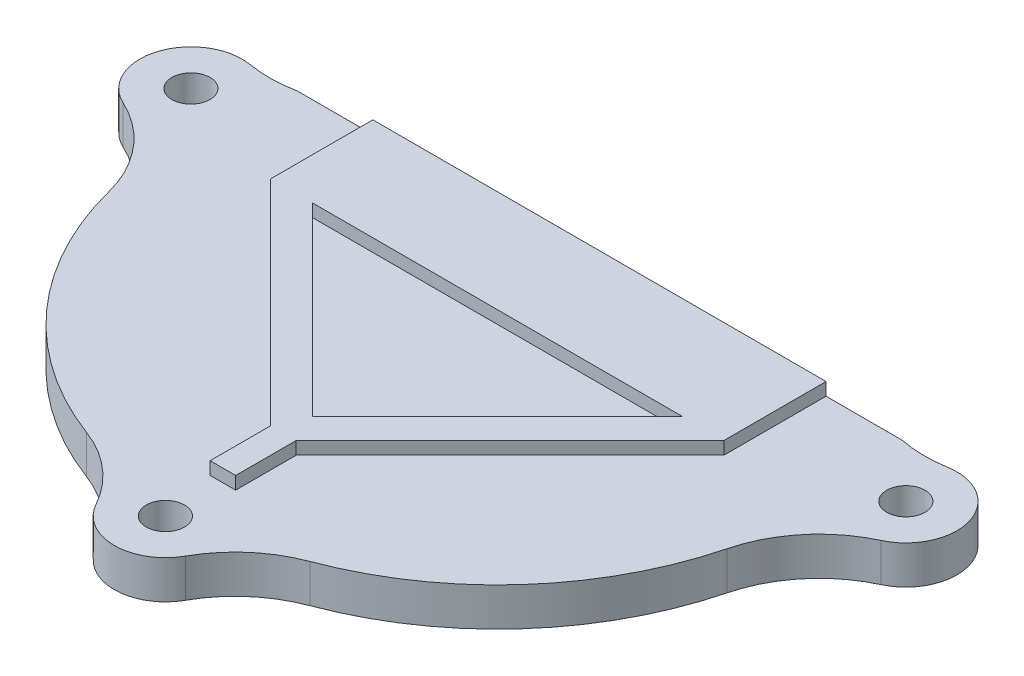
ISO-10303-21;
HEADER;
FILE_DESCRIPTION(('STEP AP214'),'2;1');
FILE_NAME('part.step','',(''),(''),'','','');
FILE_SCHEMA(('AUTOMOTIVE_DESIGN { 1 0 10303 214 1 1 1 1 }'));
ENDSEC;
DATA;
#1=APPLICATION_CONTEXT('core data for automotive mechanical design processes');
#2=APPLICATION_PROTOCOL_DEFINITION('international standard','automotive_design',2000,#1);
#3=PRODUCT_CONTEXT('',#1,'mechanical');
#4=PRODUCT('Part','Part','',(#3));
#5=PRODUCT_RELATED_PRODUCT_CATEGORY('part','',(#4));
#6=PRODUCT_DEFINITION_FORMATION('','',#4);
#7=PRODUCT_DEFINITION_CONTEXT('part definition',#1,'design');
#8=PRODUCT_DEFINITION('design','',#6,#7);
#9=PRODUCT_DEFINITION_SHAPE('','',#8);
#10=(LENGTH_UNIT() NAMED_UNIT(*) SI_UNIT(.MILLI.,.METRE.));
#11=(NAMED_UNIT(*) PLANE_ANGLE_UNIT() SI_UNIT($,.RADIAN.));
#12=(NAMED_UNIT(*) SI_UNIT($,.STERADIAN.) SOLID_ANGLE_UNIT());
#13=UNCERTAINTY_MEASURE_WITH_UNIT(LENGTH_MEASURE(1.E-05),#10,'distance_accuracy_value','');
#14=(GEOMETRIC_REPRESENTATION_CONTEXT(3) GLOBAL_UNCERTAINTY_ASSIGNED_CONTEXT((#13)) GLOBAL_UNIT_ASSIGNED_CONTEXT((#10,
#11,#12)) REPRESENTATION_CONTEXT('',''));
#15=CARTESIAN_POINT('',(0.,0.,0.));
#16=DIRECTION('',(0.,0.,1.));
#17=DIRECTION('',(1.,0.,0.));
#18=AXIS2_PLACEMENT_3D('',#15,#16,#17);
#19=CARTESIAN_POINT('',(57.9277984312657,2.,35.3394238594462));
#20=DIRECTION('',(0.,-1.,0.));
#21=DIRECTION('',(0.,0.,-1.));
#22=AXIS2_PLACEMENT_3D('',#19,#20,#21);
#23=CYLINDRICAL_SURFACE('',#22,25.);
#24=CARTESIAN_POINT('',(57.9277984312657,-1.,35.3394238594462));
#25=DIRECTION('',(0.,-1.,0.));
#26=DIRECTION('',(0.,0.,-1.));
#27=AXIS2_PLACEMENT_3D('',#24,#25,#26);
#28=CIRCLE('',#27,25.);
#29=CARTESIAN_POINT('',(49.1820475696715,-1.,58.7597535297759));
#30=VERTEX_POINT('',#29);
#31=CARTESIAN_POINT('',(33.7114973293791,-1.,41.549960144081));
#32=VERTEX_POINT('',#31);
#33=EDGE_CURVE('E392',#30,#32,#28,.T.);
#34=ORIENTED_EDGE('',*,*,#33,.F.);
#35=DIRECTION('',(0.,-1.,0.));
#36=VECTOR('',#35,1.);
#37=CARTESIAN_POINT('',(49.1820475696715,2.,58.7597535297759));
#38=LINE('',#37,#36);
#39=CARTESIAN_POINT('',(49.1820475696715,2.,58.7597535297759));
#40=VERTEX_POINT('',#39);
#41=EDGE_CURVE('E292',#30,#40,#38,.F.);
#42=ORIENTED_EDGE('',*,*,#41,.T.);
#43=CARTESIAN_POINT('',(57.9277984312657,2.,35.3394238594462));
#44=DIRECTION('',(0.,1.,0.));
#45=DIRECTION('',(0.,0.,1.));
#46=AXIS2_PLACEMENT_3D('',#43,#44,#45);
#47=CIRCLE('',#46,25.);
#48=CARTESIAN_POINT('',(33.7114973293791,2.,41.549960144081));
#49=VERTEX_POINT('',#48);
#50=EDGE_CURVE('E276',#49,#40,#47,.T.);
#51=ORIENTED_EDGE('',*,*,#50,.F.);
#52=DIRECTION('',(0.,-1.,0.));
#53=VECTOR('',#52,1.);
#54=CARTESIAN_POINT('',(33.7114973293791,2.,41.549960144081));
#55=LINE('',#54,#53);
#56=EDGE_CURVE('E289',#49,#32,#55,.T.);
#57=ORIENTED_EDGE('',*,*,#56,.T.);
#58=EDGE_LOOP('',(#34,#42,#51,#57));
#59=FACE_BOUND('',#58,.T.);
#60=ADVANCED_FACE('F41',(#59),#23,.T.);
#61=CARTESIAN_POINT('',(57.9277984312657,-1.,35.3394238594462));
#62=DIRECTION('',(0.,-1.,0.));
#63=DIRECTION('',(0.,0.,-1.));
#64=AXIS2_PLACEMENT_3D('',#61,#62,#63);
#65=CIRCLE('',#64,25.);
#66=CARTESIAN_POINT('',(82.1440995331523,-1.,41.549960144081));
#67=VERTEX_POINT('',#66);
#68=CARTESIAN_POINT('',(66.6735492928599,-1.,58.7597535297759));
#69=VERTEX_POINT('',#68);
#70=EDGE_CURVE('E380',#67,#69,#65,.T.);
#71=ORIENTED_EDGE('',*,*,#70,.F.);
#72=DIRECTION('',(0.,-1.,0.));
#73=VECTOR('',#72,1.);
#74=CARTESIAN_POINT('',(82.1440995331523,2.,41.549960144081));
#75=LINE('',#74,#73);
#76=CARTESIAN_POINT('',(82.1440995331523,2.,41.549960144081));
#77=VERTEX_POINT('',#76);
#78=EDGE_CURVE('E279',#67,#77,#75,.F.);
#79=ORIENTED_EDGE('',*,*,#78,.T.);
#80=CARTESIAN_POINT('',(66.6735492928599,2.,58.7597535297759));
#81=VERTEX_POINT('',#80);
#82=EDGE_CURVE('E275',#81,#77,#47,.T.);
#83=ORIENTED_EDGE('',*,*,#82,.F.);
#84=DIRECTION('',(0.,-1.,0.));
#85=VECTOR('',#84,1.);
#86=CARTESIAN_POINT('',(66.6735492928599,2.,58.7597535297759));
#87=LINE('',#86,#85);
#88=EDGE_CURVE('E281',#81,#69,#87,.T.);
#89=ORIENTED_EDGE('',*,*,#88,.T.);
#90=EDGE_LOOP('',(#71,#79,#83,#89));
#91=FACE_BOUND('',#90,.T.);
#92=ADVANCED_FACE('F429',(#91),#23,.T.);
#93=CARTESIAN_POINT('',(85.9277984312657,0.,31.3394238594462));
#94=DIRECTION('',(0.,1.,0.));
#95=DIRECTION('',(0.,0.,1.));
#96=AXIS2_PLACEMENT_3D('',#93,#94,#95);
#97=CYLINDRICAL_SURFACE('',#96,3.99999999999999);
#98=CARTESIAN_POINT('',(85.9277984312657,-1.,31.3394238594462));
#99=DIRECTION('',(0.,-1.,0.));
#100=DIRECTION('',(0.,0.,-1.));
#101=AXIS2_PLACEMENT_3D('',#98,#99,#100);
#102=CIRCLE('',#101,3.99999999999999);
#103=CARTESIAN_POINT('',(87.6143188720203,-1.,34.9664955161573));
#104=VERTEX_POINT('',#103);
#105=CARTESIAN_POINT('',(85.2592728947169,-1.,27.3956853276744));
#106=VERTEX_POINT('',#105);
#107=EDGE_CURVE('E386',#104,#106,#102,.F.);
#108=ORIENTED_EDGE('',*,*,#107,.T.);
#109=DIRECTION('',(0.,1.,0.));
#110=VECTOR('',#109,1.);
#111=CARTESIAN_POINT('',(85.2592728947169,0.,27.3956853276744));
#112=LINE('',#111,#110);
#113=CARTESIAN_POINT('',(85.2592728947169,2.,27.3956853276744));
#114=VERTEX_POINT('',#113);
#115=EDGE_CURVE('E298',#106,#114,#112,.T.);
#116=ORIENTED_EDGE('',*,*,#115,.T.);
#117=CARTESIAN_POINT('',(85.9277984312657,2.,31.3394238594462));
#118=DIRECTION('',(0.,1.,0.));
#119=DIRECTION('',(0.,0.,1.));
#120=AXIS2_PLACEMENT_3D('',#117,#118,#119);
#121=CIRCLE('',#120,3.99999999999999);
#122=CARTESIAN_POINT('',(87.6143188720203,2.,34.9664955161573));
#123=VERTEX_POINT('',#122);
#124=EDGE_CURVE('E272',#123,#114,#121,.T.);
#125=ORIENTED_EDGE('',*,*,#124,.F.);
#126=DIRECTION('',(0.,1.,0.));
#127=VECTOR('',#126,1.);
#128=CARTESIAN_POINT('',(87.6143188720203,0.,34.9664955161573));
#129=LINE('',#128,#127);
#130=EDGE_CURVE('E300',#123,#104,#129,.F.);
#131=ORIENTED_EDGE('',*,*,#130,.T.);
#132=EDGE_LOOP('',(#108,#116,#125,#131));
#133=FACE_BOUND('',#132,.T.);
#134=ADVANCED_FACE('F439',(#133),#97,.T.);
#135=CARTESIAN_POINT('',(85.9277984312657,0.,31.3394238594462));
#136=DIRECTION('',(0.,1.,0.));
#137=DIRECTION('',(0.,0.,1.));
#138=AXIS2_PLACEMENT_3D('',#135,#136,#137);
#139=CYLINDRICAL_SURFACE('',#138,1.5);
#140=CARTESIAN_POINT('',(85.9277984312657,2.,31.3394238594462));
#141=DIRECTION('',(0.,1.,0.));
#142=DIRECTION('',(0.,0.,1.));
#143=AXIS2_PLACEMENT_3D('',#140,#141,#142);
#144=CIRCLE('',#143,1.5);
#145=CARTESIAN_POINT('',(85.9277984312657,2.,32.8394238594462));
#146=VERTEX_POINT('',#145);
#147=EDGE_CURVE('E269',#146,#146,#144,.T.);
#148=ORIENTED_EDGE('',*,*,#147,.T.);
#149=EDGE_LOOP('',(#148));
#150=FACE_BOUND('',#149,.T.);
#151=CARTESIAN_POINT('',(85.9277984312657,-1.,31.3394238594462));
#152=DIRECTION('',(0.,-1.,0.));
#153=DIRECTION('',(0.,0.,-1.));
#154=AXIS2_PLACEMENT_3D('',#151,#152,#153);
#155=CIRCLE('',#154,1.5);
#156=CARTESIAN_POINT('',(85.9277984312657,-1.,29.8394238594462));
#157=VERTEX_POINT('',#156);
#158=EDGE_CURVE('E333',#157,#157,#155,.F.);
#159=ORIENTED_EDGE('',*,*,#158,.F.);
#160=EDGE_LOOP('',(#159));
#161=FACE_BOUND('',#160,.T.);
#162=ADVANCED_FACE('F606',(#150,#161),#139,.F.);
#163=CARTESIAN_POINT('',(29.9277984312657,0.,31.3394238594462));
#164=DIRECTION('',(0.,1.,0.));
#165=DIRECTION('',(0.,0.,1.));
#166=AXIS2_PLACEMENT_3D('',#163,#164,#165);
#167=CYLINDRICAL_SURFACE('',#166,4.);
#168=CARTESIAN_POINT('',(29.9277984312657,-1.,31.3394238594462));
#169=DIRECTION('',(0.,-1.,0.));
#170=DIRECTION('',(0.,0.,-1.));
#171=AXIS2_PLACEMENT_3D('',#168,#169,#170);
#172=CIRCLE('',#171,4.);
#173=CARTESIAN_POINT('',(30.5963239678145,-1.,27.3956853276744));
#174=VERTEX_POINT('',#173);
#175=CARTESIAN_POINT('',(28.2412779905111,-1.,34.9664955161573));
#176=VERTEX_POINT('',#175);
#177=EDGE_CURVE('E55',#174,#176,#172,.F.);
#178=ORIENTED_EDGE('',*,*,#177,.T.);
#179=DIRECTION('',(0.,1.,0.));
#180=VECTOR('',#179,1.);
#181=CARTESIAN_POINT('',(28.2412779905111,0.,34.9664955161573));
#182=LINE('',#181,#180);
#183=CARTESIAN_POINT('',(28.2412779905111,2.,34.9664955161573));
#184=VERTEX_POINT('',#183);
#185=EDGE_CURVE('E296',#176,#184,#182,.T.);
#186=ORIENTED_EDGE('',*,*,#185,.T.);
#187=CARTESIAN_POINT('',(29.9277984312657,2.,31.3394238594462));
#188=DIRECTION('',(0.,1.,0.));
#189=DIRECTION('',(0.,0.,1.));
#190=AXIS2_PLACEMENT_3D('',#187,#188,#189);
#191=CIRCLE('',#190,4.);
#192=CARTESIAN_POINT('',(30.5963239678145,2.,27.3956853276744));
#193=VERTEX_POINT('',#192);
#194=EDGE_CURVE('E266',#193,#184,#191,.T.);
#195=ORIENTED_EDGE('',*,*,#194,.F.);
#196=DIRECTION('',(0.,1.,0.));
#197=VECTOR('',#196,1.);
#198=CARTESIAN_POINT('',(30.5963239678145,0.,27.3956853276744));
#199=LINE('',#198,#197);
#200=EDGE_CURVE('E294',#193,#174,#199,.F.);
#201=ORIENTED_EDGE('',*,*,#200,.T.);
#202=EDGE_LOOP('',(#178,#186,#195,#201));
#203=FACE_BOUND('',#202,.T.);
#204=ADVANCED_FACE('F400',(#203),#167,.T.);
#205=CARTESIAN_POINT('',(57.9277984312657,0.,61.3394238594462));
#206=DIRECTION('',(0.,1.,0.));
#207=DIRECTION('',(0.,0.,1.));
#208=AXIS2_PLACEMENT_3D('',#205,#206,#207);
#209=CYLINDRICAL_SURFACE('',#208,4.00000000000001);
#210=DIRECTION('',(0.,1.,0.));
#211=VECTOR('',#210,1.);
#212=CARTESIAN_POINT('',(54.429498086628,0.,63.2789842990067));
#213=LINE('',#212,#211);
#214=CARTESIAN_POINT('',(54.429498086628,2.,63.2789842990067));
#215=VERTEX_POINT('',#214);
#216=CARTESIAN_POINT('',(54.429498086628,-1.,63.2789842990067));
#217=VERTEX_POINT('',#216);
#218=EDGE_CURVE('E284',#215,#217,#213,.F.);
#219=ORIENTED_EDGE('',*,*,#218,.T.);
#220=CARTESIAN_POINT('',(57.9277984312657,-1.,61.3394238594462));
#221=DIRECTION('',(0.,-1.,0.));
#222=DIRECTION('',(0.,0.,-1.));
#223=AXIS2_PLACEMENT_3D('',#220,#221,#222);
#224=CIRCLE('',#223,4.00000000000001);
#225=CARTESIAN_POINT('',(61.4260987759034,-1.,63.2789842990067));
#226=VERTEX_POINT('',#225);
#227=EDGE_CURVE('E387',#217,#226,#224,.F.);
#228=ORIENTED_EDGE('',*,*,#227,.T.);
#229=DIRECTION('',(0.,1.,0.));
#230=VECTOR('',#229,1.);
#231=CARTESIAN_POINT('',(61.4260987759034,0.,63.2789842990067));
#232=LINE('',#231,#230);
#233=CARTESIAN_POINT('',(61.4260987759034,2.,63.2789842990067));
#234=VERTEX_POINT('',#233);
#235=EDGE_CURVE('E287',#226,#234,#232,.T.);
#236=ORIENTED_EDGE('',*,*,#235,.T.);
#237=CARTESIAN_POINT('',(57.9277984312657,2.,61.3394238594462));
#238=DIRECTION('',(0.,1.,0.));
#239=DIRECTION('',(0.,0.,1.));
#240=AXIS2_PLACEMENT_3D('',#237,#238,#239);
#241=CIRCLE('',#240,4.00000000000001);
#242=EDGE_CURVE('E263',#215,#234,#241,.T.);
#243=ORIENTED_EDGE('',*,*,#242,.F.);
#244=EDGE_LOOP('',(#219,#228,#236,#243));
#245=FACE_BOUND('',#244,.T.);
#246=ADVANCED_FACE('F419',(#245),#209,.T.);
#247=CARTESIAN_POINT('',(57.9277984312657,0.,61.3394238594462));
#248=DIRECTION('',(0.,1.,0.));
#249=DIRECTION('',(0.,0.,1.));
#250=AXIS2_PLACEMENT_3D('',#247,#248,#249);
#251=CYLINDRICAL_SURFACE('',#250,1.5);
#252=CARTESIAN_POINT('',(57.9277984312657,2.,61.3394238594462));
#253=DIRECTION('',(0.,1.,0.));
#254=DIRECTION('',(0.,0.,1.));
#255=AXIS2_PLACEMENT_3D('',#252,#253,#254);
#256=CIRCLE('',#255,1.5);
#257=CARTESIAN_POINT('',(57.9277984312657,2.,62.8394238594462));
#258=VERTEX_POINT('',#257);
#259=EDGE_CURVE('E260',#258,#258,#256,.T.);
#260=ORIENTED_EDGE('',*,*,#259,.T.);
#261=EDGE_LOOP('',(#260));
#262=FACE_BOUND('',#261,.T.);
#263=CARTESIAN_POINT('',(57.9277984312657,-1.,61.3394238594462));
#264=DIRECTION('',(0.,-1.,0.));
#265=DIRECTION('',(0.,0.,-1.));
#266=AXIS2_PLACEMENT_3D('',#263,#264,#265);
#267=CIRCLE('',#266,1.5);
#268=CARTESIAN_POINT('',(57.9277984312657,-1.,59.8394238594462));
#269=VERTEX_POINT('',#268);
#270=EDGE_CURVE('E374',#269,#269,#267,.F.);
#271=ORIENTED_EDGE('',*,*,#270,.F.);
#272=EDGE_LOOP('',(#271));
#273=FACE_BOUND('',#272,.T.);
#274=ADVANCED_FACE('F634',(#262,#273),#251,.F.);
#275=CARTESIAN_POINT('',(29.9277984312657,0.,31.3394238594462));
#276=DIRECTION('',(0.,1.,0.));
#277=DIRECTION('',(0.,0.,1.));
#278=AXIS2_PLACEMENT_3D('',#275,#276,#277);
#279=CYLINDRICAL_SURFACE('',#278,1.5);
#280=CARTESIAN_POINT('',(29.9277984312657,2.,31.3394238594462));
#281=DIRECTION('',(0.,1.,0.));
#282=DIRECTION('',(0.,0.,1.));
#283=AXIS2_PLACEMENT_3D('',#280,#281,#282);
#284=CIRCLE('',#283,1.5);
#285=CARTESIAN_POINT('',(29.9277984312657,2.,32.8394238594462));
#286=VERTEX_POINT('',#285);
#287=EDGE_CURVE('E257',#286,#286,#284,.T.);
#288=ORIENTED_EDGE('',*,*,#287,.T.);
#289=EDGE_LOOP('',(#288));
#290=FACE_BOUND('',#289,.T.);
#291=CARTESIAN_POINT('',(29.9277984312657,-1.,31.3394238594462));
#292=DIRECTION('',(0.,-1.,0.));
#293=DIRECTION('',(0.,0.,-1.));
#294=AXIS2_PLACEMENT_3D('',#291,#292,#293);
#295=CIRCLE('',#294,1.5);
#296=CARTESIAN_POINT('',(29.9277984312657,-1.,29.8394238594462));
#297=VERTEX_POINT('',#296);
#298=EDGE_CURVE('E377',#297,#297,#295,.F.);
#299=ORIENTED_EDGE('',*,*,#298,.F.);
#300=EDGE_LOOP('',(#299));
#301=FACE_BOUND('',#300,.T.);
#302=ADVANCED_FACE('F644',(#290,#301),#279,.F.);
#303=CARTESIAN_POINT('',(40.1777984312657,3.,27.3394238594462));
#304=DIRECTION('',(0.,0.,1.));
#305=DIRECTION('',(1.,0.,0.));
#306=AXIS2_PLACEMENT_3D('',#303,#304,#305);
#307=PLANE('',#306);
#308=DIRECTION('',(1.,0.,0.));
#309=VECTOR('',#308,1.);
#310=CARTESIAN_POINT('',(40.1777984312657,-1.,27.3394238594462));
#311=LINE('',#310,#309);
#312=CARTESIAN_POINT('',(34.2423598666117,-1.,27.3394238594463));
#313=VERTEX_POINT('',#312);
#314=CARTESIAN_POINT('',(81.6132369959197,-1.,27.3394238594462));
#315=VERTEX_POINT('',#314);
#316=EDGE_CURVE('E196',#313,#315,#311,.T.);
#317=ORIENTED_EDGE('',*,*,#316,.F.);
#318=DIRECTION('',(0.,-1.,0.));
#319=VECTOR('',#318,1.);
#320=CARTESIAN_POINT('',(34.2423598666117,2.,27.3394238594463));
#321=LINE('',#320,#319);
#322=CARTESIAN_POINT('',(34.2423598666117,2.,27.3394238594463));
#323=VERTEX_POINT('',#322);
#324=EDGE_CURVE('E206',#323,#313,#321,.T.);
#325=ORIENTED_EDGE('',*,*,#324,.F.);
#326=DIRECTION('',(1.,0.,0.));
#327=VECTOR('',#326,1.);
#328=CARTESIAN_POINT('',(85.9277984312657,2.,27.3394238594462));
#329=LINE('',#328,#327);
#330=CARTESIAN_POINT('',(40.1777984312657,2.,27.3394238594462));
#331=VERTEX_POINT('',#330);
#332=EDGE_CURVE('E217',#323,#331,#329,.T.);
#333=ORIENTED_EDGE('',*,*,#332,.T.);
#334=DIRECTION('',(0.,-1.,0.));
#335=VECTOR('',#334,1.);
#336=CARTESIAN_POINT('',(40.1777984312657,3.,27.3394238594462));
#337=LINE('',#336,#335);
#338=CARTESIAN_POINT('',(40.1777984312657,3.,27.3394238594462));
#339=VERTEX_POINT('',#338);
#340=EDGE_CURVE('E251',#339,#331,#337,.T.);
#341=ORIENTED_EDGE('',*,*,#340,.F.);
#342=DIRECTION('',(-1.,0.,0.));
#343=VECTOR('',#342,1.);
#344=CARTESIAN_POINT('',(40.1777984312657,3.,27.3394238594462));
#345=LINE('',#344,#343);
#346=CARTESIAN_POINT('',(75.6777984312657,3.,27.3394238594462));
#347=VERTEX_POINT('',#346);
#348=EDGE_CURVE('E227',#347,#339,#345,.T.);
#349=ORIENTED_EDGE('',*,*,#348,.F.);
#350=DIRECTION('',(0.,-1.,0.));
#351=VECTOR('',#350,1.);
#352=CARTESIAN_POINT('',(75.6777984312657,3.,27.3394238594462));
#353=LINE('',#352,#351);
#354=CARTESIAN_POINT('',(75.6777984312657,2.,27.3394238594462));
#355=VERTEX_POINT('',#354);
#356=EDGE_CURVE('E254',#347,#355,#353,.T.);
#357=ORIENTED_EDGE('',*,*,#356,.T.);
#358=CARTESIAN_POINT('',(81.6132369959197,2.,27.3394238594462));
#359=VERTEX_POINT('',#358);
#360=EDGE_CURVE('E342',#355,#359,#329,.T.);
#361=ORIENTED_EDGE('',*,*,#360,.T.);
#362=DIRECTION('',(0.,-1.,0.));
#363=VECTOR('',#362,1.);
#364=CARTESIAN_POINT('',(81.6132369959197,2.,27.3394238594462));
#365=LINE('',#364,#363);
#366=EDGE_CURVE('E209',#315,#359,#365,.F.);
#367=ORIENTED_EDGE('',*,*,#366,.F.);
#368=EDGE_LOOP('',(#317,#325,#333,#341,#349,#357,#361,#367));
#369=FACE_BOUND('',#368,.T.);
#370=ADVANCED_FACE('F205',(#369),#307,.F.);
#371=CARTESIAN_POINT('',(70.1718496374976,0.,68.1278853979078));
#372=DIRECTION('',(0.,1.,0.));
#373=DIRECTION('',(0.,0.,1.));
#374=AXIS2_PLACEMENT_3D('',#371,#372,#373);
#375=CYLINDRICAL_SURFACE('',#374,10.);
#376=CARTESIAN_POINT('',(70.1718496374976,-1.,68.1278853979078));
#377=DIRECTION('',(0.,-1.,0.));
#378=DIRECTION('',(0.,0.,-1.));
#379=AXIS2_PLACEMENT_3D('',#376,#377,#378);
#380=CIRCLE('',#379,10.);
#381=EDGE_CURVE('E382',#69,#226,#380,.F.);
#382=ORIENTED_EDGE('',*,*,#381,.F.);
#383=ORIENTED_EDGE('',*,*,#88,.F.);
#384=CARTESIAN_POINT('',(70.1718496374976,2.,68.1278853979078));
#385=DIRECTION('',(0.,1.,0.));
#386=DIRECTION('',(0.,0.,1.));
#387=AXIS2_PLACEMENT_3D('',#384,#385,#386);
#388=CIRCLE('',#387,10.);
#389=EDGE_CURVE('E303',#234,#81,#388,.F.);
#390=ORIENTED_EDGE('',*,*,#389,.F.);
#391=ORIENTED_EDGE('',*,*,#235,.F.);
#392=EDGE_LOOP('',(#382,#383,#390,#391));
#393=FACE_BOUND('',#392,.T.);
#394=ADVANCED_FACE('F423',(#393),#375,.F.);
#395=CARTESIAN_POINT('',(45.6837472250338,0.,68.1278853979078));
#396=DIRECTION('',(0.,-1.,0.));
#397=DIRECTION('',(0.,0.,-1.));
#398=AXIS2_PLACEMENT_3D('',#395,#396,#397);
#399=CYLINDRICAL_SURFACE('',#398,10.);
#400=CARTESIAN_POINT('',(45.6837472250338,-1.,68.1278853979078));
#401=DIRECTION('',(0.,-1.,0.));
#402=DIRECTION('',(0.,0.,-1.));
#403=AXIS2_PLACEMENT_3D('',#400,#401,#402);
#404=CIRCLE('',#403,10.);
#405=EDGE_CURVE('E390',#217,#30,#404,.F.);
#406=ORIENTED_EDGE('',*,*,#405,.F.);
#407=ORIENTED_EDGE('',*,*,#218,.F.);
#408=CARTESIAN_POINT('',(45.6837472250338,2.,68.1278853979078));
#409=DIRECTION('',(0.,1.,0.));
#410=DIRECTION('',(0.,0.,1.));
#411=AXIS2_PLACEMENT_3D('',#408,#409,#410);
#412=CIRCLE('',#411,10.);
#413=EDGE_CURVE('E305',#40,#215,#412,.F.);
#414=ORIENTED_EDGE('',*,*,#413,.F.);
#415=ORIENTED_EDGE('',*,*,#41,.F.);
#416=EDGE_LOOP('',(#406,#407,#414,#415));
#417=FACE_BOUND('',#416,.T.);
#418=ADVANCED_FACE('F415',(#417),#399,.F.);
#419=CARTESIAN_POINT('',(24.0249768886245,0.,44.034174657935));
#420=DIRECTION('',(0.,1.,0.));
#421=DIRECTION('',(0.,0.,1.));
#422=AXIS2_PLACEMENT_3D('',#419,#420,#421);
#423=CYLINDRICAL_SURFACE('',#422,10.);
#424=CARTESIAN_POINT('',(24.0249768886245,-1.,44.034174657935));
#425=DIRECTION('',(0.,-1.,0.));
#426=DIRECTION('',(0.,0.,-1.));
#427=AXIS2_PLACEMENT_3D('',#424,#425,#426);
#428=CIRCLE('',#427,10.);
#429=EDGE_CURVE('E394',#32,#176,#428,.F.);
#430=ORIENTED_EDGE('',*,*,#429,.F.);
#431=ORIENTED_EDGE('',*,*,#56,.F.);
#432=CARTESIAN_POINT('',(24.0249768886245,2.,44.034174657935));
#433=DIRECTION('',(0.,1.,0.));
#434=DIRECTION('',(0.,0.,1.));
#435=AXIS2_PLACEMENT_3D('',#432,#433,#434);
#436=CIRCLE('',#435,10.);
#437=EDGE_CURVE('E307',#184,#49,#436,.F.);
#438=ORIENTED_EDGE('',*,*,#437,.F.);
#439=ORIENTED_EDGE('',*,*,#185,.F.);
#440=EDGE_LOOP('',(#430,#431,#438,#439));
#441=FACE_BOUND('',#440,.T.);
#442=ADVANCED_FACE('F407',(#441),#423,.F.);
#443=CARTESIAN_POINT('',(91.830619973907,0.,44.0341746579349));
#444=DIRECTION('',(0.,-1.,0.));
#445=DIRECTION('',(0.,0.,-1.));
#446=AXIS2_PLACEMENT_3D('',#443,#444,#445);
#447=CYLINDRICAL_SURFACE('',#446,10.);
#448=CARTESIAN_POINT('',(91.830619973907,-1.,44.0341746579349));
#449=DIRECTION('',(0.,-1.,0.));
#450=DIRECTION('',(0.,0.,-1.));
#451=AXIS2_PLACEMENT_3D('',#448,#449,#450);
#452=CIRCLE('',#451,10.);
#453=EDGE_CURVE('E384',#104,#67,#452,.F.);
#454=ORIENTED_EDGE('',*,*,#453,.F.);
#455=ORIENTED_EDGE('',*,*,#130,.F.);
#456=CARTESIAN_POINT('',(91.830619973907,2.,44.0341746579349));
#457=DIRECTION('',(0.,1.,0.));
#458=DIRECTION('',(0.,0.,1.));
#459=AXIS2_PLACEMENT_3D('',#456,#457,#458);
#460=CIRCLE('',#459,10.);
#461=EDGE_CURVE('E309',#77,#123,#460,.F.);
#462=ORIENTED_EDGE('',*,*,#461,.F.);
#463=ORIENTED_EDGE('',*,*,#78,.F.);
#464=EDGE_LOOP('',(#454,#455,#462,#463));
#465=FACE_BOUND('',#464,.T.);
#466=ADVANCED_FACE('F435',(#465),#447,.F.);
#467=CARTESIAN_POINT('',(83.5879590533449,0.,17.5363389982447));
#468=DIRECTION('',(0.,1.,0.));
#469=DIRECTION('',(0.,0.,1.));
#470=AXIS2_PLACEMENT_3D('',#467,#468,#469);
#471=CYLINDRICAL_SURFACE('',#470,10.);
#472=CARTESIAN_POINT('',(83.5879590533449,-1.,17.5363389982447));
#473=DIRECTION('',(0.,-1.,0.));
#474=DIRECTION('',(0.,0.,-1.));
#475=AXIS2_PLACEMENT_3D('',#472,#473,#474);
#476=CIRCLE('',#475,10.);
#477=EDGE_CURVE('E397',#315,#106,#476,.F.);
#478=ORIENTED_EDGE('',*,*,#477,.F.);
#479=ORIENTED_EDGE('',*,*,#366,.T.);
#480=CARTESIAN_POINT('',(83.5879590533449,2.,17.5363389982447));
#481=DIRECTION('',(0.,1.,0.));
#482=DIRECTION('',(0.,0.,1.));
#483=AXIS2_PLACEMENT_3D('',#480,#481,#482);
#484=CIRCLE('',#483,10.);
#485=EDGE_CURVE('E311',#114,#359,#484,.F.);
#486=ORIENTED_EDGE('',*,*,#485,.F.);
#487=ORIENTED_EDGE('',*,*,#115,.F.);
#488=EDGE_LOOP('',(#478,#479,#486,#487));
#489=FACE_BOUND('',#488,.T.);
#490=ADVANCED_FACE('F442',(#489),#471,.F.);
#491=CARTESIAN_POINT('',(32.2676378091866,0.,17.5363389982447));
#492=DIRECTION('',(0.,-1.,0.));
#493=DIRECTION('',(0.,0.,-1.));
#494=AXIS2_PLACEMENT_3D('',#491,#492,#493);
#495=CYLINDRICAL_SURFACE('',#494,10.);
#496=CARTESIAN_POINT('',(32.2676378091866,-1.,17.5363389982447));
#497=DIRECTION('',(0.,-1.,0.));
#498=DIRECTION('',(0.,0.,-1.));
#499=AXIS2_PLACEMENT_3D('',#496,#497,#498);
#500=CIRCLE('',#499,10.);
#501=EDGE_CURVE('E11',#174,#313,#500,.F.);
#502=ORIENTED_EDGE('',*,*,#501,.F.);
#503=ORIENTED_EDGE('',*,*,#200,.F.);
#504=CARTESIAN_POINT('',(32.2676378091866,2.,17.5363389982447));
#505=DIRECTION('',(0.,1.,0.));
#506=DIRECTION('',(0.,0.,1.));
#507=AXIS2_PLACEMENT_3D('',#504,#505,#506);
#508=CIRCLE('',#507,10.);
#509=EDGE_CURVE('E211',#323,#193,#508,.F.);
#510=ORIENTED_EDGE('',*,*,#509,.F.);
#511=ORIENTED_EDGE('',*,*,#324,.T.);
#512=EDGE_LOOP('',(#502,#503,#510,#511));
#513=FACE_BOUND('',#512,.T.);
#514=ADVANCED_FACE('F43',(#513),#495,.F.);
#515=CARTESIAN_POINT('',(57.9277984312657,2.,35.3394238594462));
#516=DIRECTION('',(0.,1.,0.));
#517=DIRECTION('',(0.,0.,1.));
#518=AXIS2_PLACEMENT_3D('',#515,#516,#517);
#519=PLANE('',#518);
#520=ORIENTED_EDGE('',*,*,#147,.F.);
#521=EDGE_LOOP('',(#520));
#522=FACE_BOUND('',#521,.T.);
#523=ORIENTED_EDGE('',*,*,#259,.F.);
#524=EDGE_LOOP('',(#523));
#525=FACE_BOUND('',#524,.T.);
#526=ORIENTED_EDGE('',*,*,#287,.F.);
#527=EDGE_LOOP('',(#526));
#528=FACE_BOUND('',#527,.T.);
#529=DIRECTION('',(1.,0.,0.));
#530=VECTOR('',#529,1.);
#531=CARTESIAN_POINT('',(58.9277984312657,2.,56.8351128737705));
#532=LINE('',#531,#530);
#533=CARTESIAN_POINT('',(56.9277984312657,2.,56.8351128737705));
#534=VERTEX_POINT('',#533);
#535=CARTESIAN_POINT('',(58.9277984312657,2.,56.8351128737705));
#536=VERTEX_POINT('',#535);
#537=EDGE_CURVE('E332',#534,#536,#532,.T.);
#538=ORIENTED_EDGE('',*,*,#537,.F.);
#539=DIRECTION('',(0.,0.,1.));
#540=VECTOR('',#539,1.);
#541=CARTESIAN_POINT('',(56.9277984312657,2.,49.8351128737705));
#542=LINE('',#541,#540);
#543=CARTESIAN_POINT('',(56.9277984312657,2.,52.0894238594458));
#544=VERTEX_POINT('',#543);
#545=EDGE_CURVE('E321',#544,#534,#542,.T.);
#546=ORIENTED_EDGE('',*,*,#545,.F.);
#547=DIRECTION('',(0.707106781186556,0.,0.707106781186539));
#548=VECTOR('',#547,1.);
#549=CARTESIAN_POINT('',(40.1777984312657,2.,35.3394238594462));
#550=LINE('',#549,#548);
#551=CARTESIAN_POINT('',(40.1777984312657,2.,35.3394238594462));
#552=VERTEX_POINT('',#551);
#553=EDGE_CURVE('E242',#552,#544,#550,.T.);
#554=ORIENTED_EDGE('',*,*,#553,.F.);
#555=DIRECTION('',(0.,0.,1.));
#556=VECTOR('',#555,1.);
#557=CARTESIAN_POINT('',(40.1777984312657,2.,35.3394238594462));
#558=LINE('',#557,#556);
#559=EDGE_CURVE('E240',#331,#552,#558,.T.);
#560=ORIENTED_EDGE('',*,*,#559,.F.);
#561=ORIENTED_EDGE('',*,*,#332,.F.);
#562=ORIENTED_EDGE('',*,*,#509,.T.);
#563=ORIENTED_EDGE('',*,*,#194,.T.);
#564=ORIENTED_EDGE('',*,*,#437,.T.);
#565=ORIENTED_EDGE('',*,*,#50,.T.);
#566=ORIENTED_EDGE('',*,*,#413,.T.);
#567=ORIENTED_EDGE('',*,*,#242,.T.);
#568=ORIENTED_EDGE('',*,*,#389,.T.);
#569=ORIENTED_EDGE('',*,*,#82,.T.);
#570=ORIENTED_EDGE('',*,*,#461,.T.);
#571=ORIENTED_EDGE('',*,*,#124,.T.);
#572=ORIENTED_EDGE('',*,*,#485,.T.);
#573=ORIENTED_EDGE('',*,*,#360,.F.);
#574=DIRECTION('',(0.,0.,-1.));
#575=VECTOR('',#574,1.);
#576=CARTESIAN_POINT('',(75.6777984312657,2.,35.3394238594462));
#577=LINE('',#576,#575);
#578=CARTESIAN_POINT('',(75.6777984312657,2.,35.3394238594462));
#579=VERTEX_POINT('',#578);
#580=EDGE_CURVE('E222',#579,#355,#577,.T.);
#581=ORIENTED_EDGE('',*,*,#580,.F.);
#582=DIRECTION('',(0.707106781186556,0.,-0.707106781186539));
#583=VECTOR('',#582,1.);
#584=CARTESIAN_POINT('',(57.9277984312657,2.,53.0894238594458));
#585=LINE('',#584,#583);
#586=CARTESIAN_POINT('',(58.9277984312657,2.,52.0894238594458));
#587=VERTEX_POINT('',#586);
#588=EDGE_CURVE('E228',#587,#579,#585,.T.);
#589=ORIENTED_EDGE('',*,*,#588,.F.);
#590=DIRECTION('',(0.,0.,-1.));
#591=VECTOR('',#590,1.);
#592=CARTESIAN_POINT('',(58.9277984312657,2.,49.8351128737705));
#593=LINE('',#592,#591);
#594=EDGE_CURVE('E365',#536,#587,#593,.T.);
#595=ORIENTED_EDGE('',*,*,#594,.F.);
#596=EDGE_LOOP('',(#538,#546,#554,#560,#561,#562,#563,#564,#565,#566,#567,#568,#569,#570,#571,
#572,#573,#581,#589,#595));
#597=FACE_BOUND('',#596,.T.);
#598=ADVANCED_FACE('F329',(#522,#525,#528,#597),#519,.T.);
#599=CARTESIAN_POINT('',(40.1777984312657,3.,35.3394238594462));
#600=DIRECTION('',(0.707106781186539,0.,-0.707106781186556));
#601=DIRECTION('',(-0.707106781186556,0.,-0.707106781186539));
#602=AXIS2_PLACEMENT_3D('',#599,#600,#601);
#603=PLANE('',#602);
#604=DIRECTION('',(0.,-1.,0.));
#605=VECTOR('',#604,1.);
#606=CARTESIAN_POINT('',(56.9277984312657,3.,52.0894238594458));
#607=LINE('',#606,#605);
#608=CARTESIAN_POINT('',(56.9277984312657,3.,52.0894238594458));
#609=VERTEX_POINT('',#608);
#610=EDGE_CURVE('E49',#609,#544,#607,.T.);
#611=ORIENTED_EDGE('',*,*,#610,.F.);
#612=DIRECTION('',(0.707106781186556,0.,0.707106781186539));
#613=VECTOR('',#612,1.);
#614=CARTESIAN_POINT('',(40.1777984312657,3.,35.3394238594462));
#615=LINE('',#614,#613);
#616=CARTESIAN_POINT('',(40.1777984312657,3.,35.3394238594462));
#617=VERTEX_POINT('',#616);
#618=EDGE_CURVE('E232',#617,#609,#615,.T.);
#619=ORIENTED_EDGE('',*,*,#618,.F.);
#620=DIRECTION('',(0.,-1.,0.));
#621=VECTOR('',#620,1.);
#622=CARTESIAN_POINT('',(40.1777984312657,3.,35.3394238594462));
#623=LINE('',#622,#621);
#624=EDGE_CURVE('E248',#617,#552,#623,.T.);
#625=ORIENTED_EDGE('',*,*,#624,.T.);
#626=ORIENTED_EDGE('',*,*,#553,.T.);
#627=EDGE_LOOP('',(#611,#619,#625,#626));
#628=FACE_BOUND('',#627,.T.);
#629=ADVANCED_FACE('F335',(#628),#603,.F.);
#630=CARTESIAN_POINT('',(57.9277984312657,3.,53.0894238594458));
#631=DIRECTION('',(-0.707106781186539,0.,-0.707106781186556));
#632=DIRECTION('',(-0.707106781186556,0.,0.707106781186539));
#633=AXIS2_PLACEMENT_3D('',#630,#631,#632);
#634=PLANE('',#633);
#635=DIRECTION('',(0.,1.,0.));
#636=VECTOR('',#635,1.);
#637=CARTESIAN_POINT('',(58.9277984312657,3.,52.0894238594458));
#638=LINE('',#637,#636);
#639=CARTESIAN_POINT('',(58.9277984312657,3.,52.0894238594458));
#640=VERTEX_POINT('',#639);
#641=EDGE_CURVE('E315',#587,#640,#638,.T.);
#642=ORIENTED_EDGE('',*,*,#641,.F.);
#643=ORIENTED_EDGE('',*,*,#588,.T.);
#644=DIRECTION('',(0.,-1.,0.));
#645=VECTOR('',#644,1.);
#646=CARTESIAN_POINT('',(75.6777984312657,3.,35.3394238594462));
#647=LINE('',#646,#645);
#648=CARTESIAN_POINT('',(75.6777984312657,3.,35.3394238594462));
#649=VERTEX_POINT('',#648);
#650=EDGE_CURVE('E237',#649,#579,#647,.T.);
#651=ORIENTED_EDGE('',*,*,#650,.F.);
#652=DIRECTION('',(0.707106781186556,0.,-0.707106781186539));
#653=VECTOR('',#652,1.);
#654=CARTESIAN_POINT('',(57.9277984312657,3.,53.0894238594458));
#655=LINE('',#654,#653);
#656=EDGE_CURVE('E235',#640,#649,#655,.T.);
#657=ORIENTED_EDGE('',*,*,#656,.F.);
#658=EDGE_LOOP('',(#642,#643,#651,#657));
#659=FACE_BOUND('',#658,.T.);
#660=ADVANCED_FACE('F452',(#659),#634,.F.);
#661=CARTESIAN_POINT('',(43.0785560263482,3.,35.3394238594462));
#662=DIRECTION('',(0.,0.,1.));
#663=DIRECTION('',(1.,0.,0.));
#664=AXIS2_PLACEMENT_3D('',#661,#662,#663);
#665=PLANE('',#664);
#666=DIRECTION('',(-1.,0.,0.));
#667=VECTOR('',#666,1.);
#668=CARTESIAN_POINT('',(43.0785560263482,3.,35.3394238594462));
#669=LINE('',#668,#667);
#670=CARTESIAN_POINT('',(72.4234874455899,3.,35.3394238594462));
#671=VERTEX_POINT('',#670);
#672=CARTESIAN_POINT('',(43.4321094169415,3.,35.3394238594462));
#673=VERTEX_POINT('',#672);
#674=EDGE_CURVE('E215',#671,#673,#669,.T.);
#675=ORIENTED_EDGE('',*,*,#674,.T.);
#676=DIRECTION('',(0.,-1.,0.));
#677=VECTOR('',#676,1.);
#678=CARTESIAN_POINT('',(43.4321094169415,3.,35.3394238594462));
#679=LINE('',#678,#677);
#680=CARTESIAN_POINT('',(43.4321094169415,2.,35.3394238594462));
#681=VERTEX_POINT('',#680);
#682=EDGE_CURVE('E343',#673,#681,#679,.T.);
#683=ORIENTED_EDGE('',*,*,#682,.T.);
#684=DIRECTION('',(-1.,0.,0.));
#685=VECTOR('',#684,1.);
#686=CARTESIAN_POINT('',(43.0785560263482,2.,35.3394238594462));
#687=LINE('',#686,#685);
#688=CARTESIAN_POINT('',(72.4234874455898,2.,35.3394238594462));
#689=VERTEX_POINT('',#688);
#690=EDGE_CURVE('E212',#689,#681,#687,.T.);
#691=ORIENTED_EDGE('',*,*,#690,.F.);
#692=DIRECTION('',(0.,-1.,0.));
#693=VECTOR('',#692,1.);
#694=CARTESIAN_POINT('',(72.4234874455899,3.,35.3394238594462));
#695=LINE('',#694,#693);
#696=EDGE_CURVE('E347',#671,#689,#695,.T.);
#697=ORIENTED_EDGE('',*,*,#696,.F.);
#698=EDGE_LOOP('',(#675,#683,#691,#697));
#699=FACE_BOUND('',#698,.T.);
#700=ADVANCED_FACE('F478',(#699),#665,.T.);
#701=ORIENTED_EDGE('',*,*,#690,.T.);
#702=DIRECTION('',(-0.707106781186545,0.,-0.70710678118655));
#703=VECTOR('',#702,1.);
#704=CARTESIAN_POINT('',(57.9277984312657,2.,49.8351128737705));
#705=LINE('',#704,#703);
#706=CARTESIAN_POINT('',(57.9277984312657,2.,49.8351128737705));
#707=VERTEX_POINT('',#706);
#708=EDGE_CURVE('E356',#707,#681,#705,.T.);
#709=ORIENTED_EDGE('',*,*,#708,.F.);
#710=DIRECTION('',(-0.707106781186543,0.,0.707106781186551));
#711=VECTOR('',#710,1.);
#712=CARTESIAN_POINT('',(57.9277984312657,2.,49.8351128737705));
#713=LINE('',#712,#711);
#714=EDGE_CURVE('E353',#689,#707,#713,.T.);
#715=ORIENTED_EDGE('',*,*,#714,.F.);
#716=EDGE_LOOP('',(#701,#709,#715));
#717=FACE_BOUND('',#716,.T.);
#718=ADVANCED_FACE('F463',(#717),#519,.T.);
#719=CARTESIAN_POINT('',(0.,3.,0.));
#720=DIRECTION('',(0.,-1.,0.));
#721=DIRECTION('',(0.,0.,-1.));
#722=AXIS2_PLACEMENT_3D('',#719,#720,#721);
#723=PLANE('',#722);
#724=ORIENTED_EDGE('',*,*,#618,.T.);
#725=DIRECTION('',(0.,0.,1.));
#726=VECTOR('',#725,1.);
#727=CARTESIAN_POINT('',(56.9277984312657,3.,49.8351128737705));
#728=LINE('',#727,#726);
#729=CARTESIAN_POINT('',(56.9277984312657,3.,56.8351128737705));
#730=VERTEX_POINT('',#729);
#731=EDGE_CURVE('E323',#609,#730,#728,.T.);
#732=ORIENTED_EDGE('',*,*,#731,.T.);
#733=DIRECTION('',(1.,0.,0.));
#734=VECTOR('',#733,1.);
#735=CARTESIAN_POINT('',(58.9277984312657,3.,56.8351128737705));
#736=LINE('',#735,#734);
#737=CARTESIAN_POINT('',(58.9277984312657,3.,56.8351128737705));
#738=VERTEX_POINT('',#737);
#739=EDGE_CURVE('E369',#730,#738,#736,.T.);
#740=ORIENTED_EDGE('',*,*,#739,.T.);
#741=DIRECTION('',(0.,0.,-1.));
#742=VECTOR('',#741,1.);
#743=CARTESIAN_POINT('',(58.9277984312657,3.,49.8351128737705));
#744=LINE('',#743,#742);
#745=EDGE_CURVE('E63',#738,#640,#744,.T.);
#746=ORIENTED_EDGE('',*,*,#745,.T.);
#747=ORIENTED_EDGE('',*,*,#656,.T.);
#748=DIRECTION('',(0.,0.,-1.));
#749=VECTOR('',#748,1.);
#750=CARTESIAN_POINT('',(75.6777984312657,3.,35.3394238594462));
#751=LINE('',#750,#749);
#752=EDGE_CURVE('E224',#649,#347,#751,.T.);
#753=ORIENTED_EDGE('',*,*,#752,.T.);
#754=ORIENTED_EDGE('',*,*,#348,.T.);
#755=DIRECTION('',(0.,0.,1.));
#756=VECTOR('',#755,1.);
#757=CARTESIAN_POINT('',(40.1777984312657,3.,35.3394238594462));
#758=LINE('',#757,#756);
#759=EDGE_CURVE('E230',#339,#617,#758,.T.);
#760=ORIENTED_EDGE('',*,*,#759,.T.);
#761=EDGE_LOOP('',(#724,#732,#740,#746,#747,#753,#754,#760));
#762=FACE_BOUND('',#761,.T.);
#763=DIRECTION('',(-0.707106781186543,0.,0.707106781186551));
#764=VECTOR('',#763,1.);
#765=CARTESIAN_POINT('',(57.9277984312657,3.,49.8351128737705));
#766=LINE('',#765,#764);
#767=CARTESIAN_POINT('',(57.9277984312657,3.,49.8351128737705));
#768=VERTEX_POINT('',#767);
#769=EDGE_CURVE('E352',#671,#768,#766,.T.);
#770=ORIENTED_EDGE('',*,*,#769,.T.);
#771=DIRECTION('',(-0.707106781186545,0.,-0.70710678118655));
#772=VECTOR('',#771,1.);
#773=CARTESIAN_POINT('',(57.9277984312657,3.,49.8351128737705));
#774=LINE('',#773,#772);
#775=EDGE_CURVE('E355',#768,#673,#774,.T.);
#776=ORIENTED_EDGE('',*,*,#775,.T.);
#777=ORIENTED_EDGE('',*,*,#674,.F.);
#778=EDGE_LOOP('',(#770,#776,#777));
#779=FACE_BOUND('',#778,.T.);
#780=ADVANCED_FACE('F460',(#762,#779),#723,.F.);
#781=CARTESIAN_POINT('',(75.6777984312657,3.,35.3394238594462));
#782=DIRECTION('',(-1.,0.,0.));
#783=DIRECTION('',(0.,0.,1.));
#784=AXIS2_PLACEMENT_3D('',#781,#782,#783);
#785=PLANE('',#784);
#786=ORIENTED_EDGE('',*,*,#580,.T.);
#787=ORIENTED_EDGE('',*,*,#356,.F.);
#788=ORIENTED_EDGE('',*,*,#752,.F.);
#789=ORIENTED_EDGE('',*,*,#650,.T.);
#790=EDGE_LOOP('',(#786,#787,#788,#789));
#791=FACE_BOUND('',#790,.T.);
#792=ADVANCED_FACE('F447',(#791),#785,.F.);
#793=CARTESIAN_POINT('',(40.1777984312657,3.,35.3394238594462));
#794=DIRECTION('',(1.,0.,0.));
#795=DIRECTION('',(0.,0.,-1.));
#796=AXIS2_PLACEMENT_3D('',#793,#794,#795);
#797=PLANE('',#796);
#798=ORIENTED_EDGE('',*,*,#559,.T.);
#799=ORIENTED_EDGE('',*,*,#624,.F.);
#800=ORIENTED_EDGE('',*,*,#759,.F.);
#801=ORIENTED_EDGE('',*,*,#340,.T.);
#802=EDGE_LOOP('',(#798,#799,#800,#801));
#803=FACE_BOUND('',#802,.T.);
#804=ADVANCED_FACE('F339',(#803),#797,.F.);
#805=CARTESIAN_POINT('',(57.9277984312657,3.,49.8351128737705));
#806=DIRECTION('',(-0.70710678118655,0.,0.707106781186545));
#807=DIRECTION('',(0.707106781186545,0.,0.70710678118655));
#808=AXIS2_PLACEMENT_3D('',#805,#806,#807);
#809=PLANE('',#808);
#810=ORIENTED_EDGE('',*,*,#708,.T.);
#811=ORIENTED_EDGE('',*,*,#682,.F.);
#812=ORIENTED_EDGE('',*,*,#775,.F.);
#813=DIRECTION('',(0.,-1.,0.));
#814=VECTOR('',#813,1.);
#815=CARTESIAN_POINT('',(57.9277984312657,3.,49.8351128737705));
#816=LINE('',#815,#814);
#817=EDGE_CURVE('E349',#768,#707,#816,.T.);
#818=ORIENTED_EDGE('',*,*,#817,.T.);
#819=EDGE_LOOP('',(#810,#811,#812,#818));
#820=FACE_BOUND('',#819,.T.);
#821=ADVANCED_FACE('F475',(#820),#809,.F.);
#822=CARTESIAN_POINT('',(57.9277984312657,3.,49.8351128737705));
#823=DIRECTION('',(0.707106781186552,0.,0.707106781186544));
#824=DIRECTION('',(0.707106781186544,0.,-0.707106781186552));
#825=AXIS2_PLACEMENT_3D('',#822,#823,#824);
#826=PLANE('',#825);
#827=ORIENTED_EDGE('',*,*,#714,.T.);
#828=ORIENTED_EDGE('',*,*,#817,.F.);
#829=ORIENTED_EDGE('',*,*,#769,.F.);
#830=ORIENTED_EDGE('',*,*,#696,.T.);
#831=EDGE_LOOP('',(#827,#828,#829,#830));
#832=FACE_BOUND('',#831,.T.);
#833=ADVANCED_FACE('F471',(#832),#826,.F.);
#834=CARTESIAN_POINT('',(56.9277984312657,3.,49.8351128737705));
#835=DIRECTION('',(1.,0.,0.));
#836=DIRECTION('',(0.,0.,-1.));
#837=AXIS2_PLACEMENT_3D('',#834,#835,#836);
#838=PLANE('',#837);
#839=ORIENTED_EDGE('',*,*,#731,.F.);
#840=ORIENTED_EDGE('',*,*,#610,.T.);
#841=ORIENTED_EDGE('',*,*,#545,.T.);
#842=DIRECTION('',(0.,-1.,0.));
#843=VECTOR('',#842,1.);
#844=CARTESIAN_POINT('',(56.9277984312657,3.,56.8351128737705));
#845=LINE('',#844,#843);
#846=EDGE_CURVE('E358',#730,#534,#845,.T.);
#847=ORIENTED_EDGE('',*,*,#846,.F.);
#848=EDGE_LOOP('',(#839,#840,#841,#847));
#849=FACE_BOUND('',#848,.T.);
#850=ADVANCED_FACE('F319',(#849),#838,.F.);
#851=CARTESIAN_POINT('',(58.9277984312657,3.,49.8351128737705));
#852=DIRECTION('',(-1.,0.,0.));
#853=DIRECTION('',(0.,0.,1.));
#854=AXIS2_PLACEMENT_3D('',#851,#852,#853);
#855=PLANE('',#854);
#856=ORIENTED_EDGE('',*,*,#594,.T.);
#857=ORIENTED_EDGE('',*,*,#641,.T.);
#858=ORIENTED_EDGE('',*,*,#745,.F.);
#859=DIRECTION('',(0.,-1.,0.));
#860=VECTOR('',#859,1.);
#861=CARTESIAN_POINT('',(58.9277984312657,3.,56.8351128737705));
#862=LINE('',#861,#860);
#863=EDGE_CURVE('E362',#738,#536,#862,.T.);
#864=ORIENTED_EDGE('',*,*,#863,.T.);
#865=EDGE_LOOP('',(#856,#857,#858,#864));
#866=FACE_BOUND('',#865,.T.);
#867=ADVANCED_FACE('F455',(#866),#855,.F.);
#868=CARTESIAN_POINT('',(58.9277984312657,3.,56.8351128737705));
#869=DIRECTION('',(0.,0.,-1.));
#870=DIRECTION('',(-1.,0.,0.));
#871=AXIS2_PLACEMENT_3D('',#868,#869,#870);
#872=PLANE('',#871);
#873=ORIENTED_EDGE('',*,*,#537,.T.);
#874=ORIENTED_EDGE('',*,*,#863,.F.);
#875=ORIENTED_EDGE('',*,*,#739,.F.);
#876=ORIENTED_EDGE('',*,*,#846,.T.);
#877=EDGE_LOOP('',(#873,#874,#875,#876));
#878=FACE_BOUND('',#877,.T.);
#879=ADVANCED_FACE('F459',(#878),#872,.F.);
#880=CARTESIAN_POINT('',(57.9277984312657,-1.,35.3394238594462));
#881=DIRECTION('',(0.,-1.,0.));
#882=DIRECTION('',(0.,0.,-1.));
#883=AXIS2_PLACEMENT_3D('',#880,#881,#882);
#884=PLANE('',#883);
#885=ORIENTED_EDGE('',*,*,#270,.T.);
#886=EDGE_LOOP('',(#885));
#887=FACE_BOUND('',#886,.T.);
#888=ORIENTED_EDGE('',*,*,#70,.T.);
#889=ORIENTED_EDGE('',*,*,#381,.T.);
#890=ORIENTED_EDGE('',*,*,#227,.F.);
#891=ORIENTED_EDGE('',*,*,#405,.T.);
#892=ORIENTED_EDGE('',*,*,#33,.T.);
#893=ORIENTED_EDGE('',*,*,#429,.T.);
#894=ORIENTED_EDGE('',*,*,#177,.F.);
#895=ORIENTED_EDGE('',*,*,#501,.T.);
#896=ORIENTED_EDGE('',*,*,#316,.T.);
#897=ORIENTED_EDGE('',*,*,#477,.T.);
#898=ORIENTED_EDGE('',*,*,#107,.F.);
#899=ORIENTED_EDGE('',*,*,#453,.T.);
#900=EDGE_LOOP('',(#888,#889,#890,#891,#892,#893,#894,#895,#896,#897,#898,#899));
#901=FACE_BOUND('',#900,.T.);
#902=ORIENTED_EDGE('',*,*,#298,.T.);
#903=EDGE_LOOP('',(#902));
#904=FACE_BOUND('',#903,.T.);
#905=ORIENTED_EDGE('',*,*,#158,.T.);
#906=EDGE_LOOP('',(#905));
#907=FACE_BOUND('',#906,.T.);
#908=ADVANCED_FACE('F193',(#887,#901,#904,#907),#884,.T.);
#909=CLOSED_SHELL('',(#60,#92,#134,#162,#204,#246,#274,#302,#370,#394,#418,#442,#466,#490,#514,
#598,#629,#660,#700,#718,#780,#792,#804,#821,#833,#850,#867,#879,#908));
#910=MANIFOLD_SOLID_BREP('B2',#909);
#911=ADVANCED_BREP_SHAPE_REPRESENTATION('',(#18,#910),#14);
#912=SHAPE_DEFINITION_REPRESENTATION(#9,#911);
ENDSEC;
END-ISO-10303-21;
